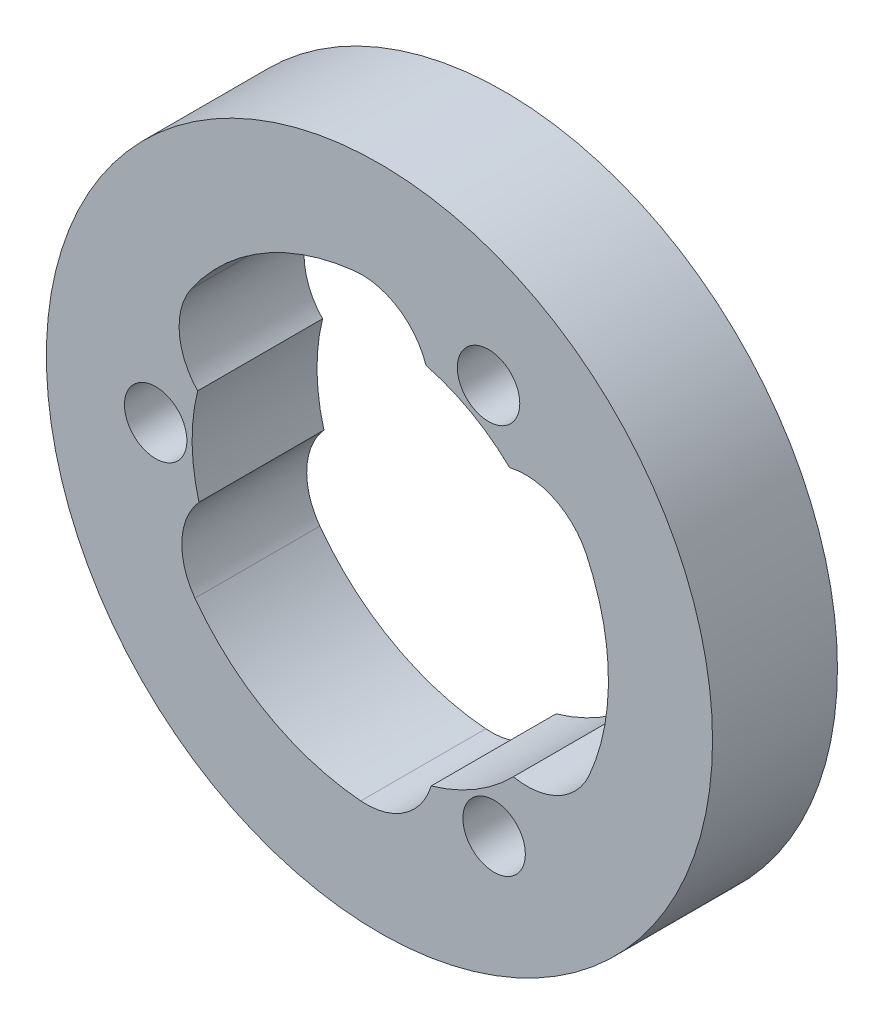
ISO-10303-21;
HEADER;
FILE_DESCRIPTION(('STEP AP214'),'2;1');
FILE_NAME('part.step','',(''),(''),'','','');
FILE_SCHEMA(('AUTOMOTIVE_DESIGN { 1 0 10303 214 1 1 1 1 }'));
ENDSEC;
DATA;
#1=APPLICATION_CONTEXT('core data for automotive mechanical design processes');
#2=APPLICATION_PROTOCOL_DEFINITION('international standard','automotive_design',2000,#1);
#3=PRODUCT_CONTEXT('',#1,'mechanical');
#4=PRODUCT('Part','Part','',(#3));
#5=PRODUCT_RELATED_PRODUCT_CATEGORY('part','',(#4));
#6=PRODUCT_DEFINITION_FORMATION('','',#4);
#7=PRODUCT_DEFINITION_CONTEXT('part definition',#1,'design');
#8=PRODUCT_DEFINITION('design','',#6,#7);
#9=PRODUCT_DEFINITION_SHAPE('','',#8);
#10=(LENGTH_UNIT() NAMED_UNIT(*) SI_UNIT(.MILLI.,.METRE.));
#11=(NAMED_UNIT(*) PLANE_ANGLE_UNIT() SI_UNIT($,.RADIAN.));
#12=(NAMED_UNIT(*) SI_UNIT($,.STERADIAN.) SOLID_ANGLE_UNIT());
#13=UNCERTAINTY_MEASURE_WITH_UNIT(LENGTH_MEASURE(1.E-05),#10,'distance_accuracy_value','');
#14=(GEOMETRIC_REPRESENTATION_CONTEXT(3) GLOBAL_UNCERTAINTY_ASSIGNED_CONTEXT((#13)) GLOBAL_UNIT_ASSIGNED_CONTEXT((#10,
#11,#12)) REPRESENTATION_CONTEXT('',''));
#15=CARTESIAN_POINT('',(0.,0.,0.));
#16=DIRECTION('',(0.,0.,1.));
#17=DIRECTION('',(1.,0.,0.));
#18=AXIS2_PLACEMENT_3D('',#15,#16,#17);
#19=CARTESIAN_POINT('',(0.,0.,6.));
#20=DIRECTION('',(0.,0.,1.));
#21=DIRECTION('',(1.,0.,0.));
#22=AXIS2_PLACEMENT_3D('',#19,#20,#21);
#23=PLANE('',#22);
#24=CARTESIAN_POINT('',(5.24045327565135,9.38616798622926,6.));
#25=DIRECTION('',(0.,0.,1.));
#26=DIRECTION('',(1.,0.,0.));
#27=AXIS2_PLACEMENT_3D('',#24,#25,#26);
#28=CIRCLE('',#27,1.50000000000234);
#29=CARTESIAN_POINT('',(6.74045327565369,9.38616798622926,6.));
#30=VERTEX_POINT('',#29);
#31=EDGE_CURVE('E168',#30,#30,#28,.T.);
#32=ORIENTED_EDGE('',*,*,#31,.F.);
#33=EDGE_LOOP('',(#32));
#34=FACE_BOUND('',#33,.T.);
#35=CARTESIAN_POINT('',(0.,0.,6.));
#36=DIRECTION('',(0.,0.,1.));
#37=DIRECTION('',(1.,0.,0.));
#38=AXIS2_PLACEMENT_3D('',#35,#36,#37);
#39=CIRCLE('',#38,16.);
#40=CARTESIAN_POINT('',(16.,0.,6.));
#41=VERTEX_POINT('',#40);
#42=EDGE_CURVE('E11',#41,#41,#39,.T.);
#43=ORIENTED_EDGE('',*,*,#42,.T.);
#44=EDGE_LOOP('',(#43));
#45=FACE_BOUND('',#44,.T.);
#46=CARTESIAN_POINT('',(-10.7488865580884,-0.154718329055183,6.));
#47=DIRECTION('',(0.,0.,1.));
#48=DIRECTION('',(1.,0.,0.));
#49=AXIS2_PLACEMENT_3D('',#46,#47,#48);
#50=CIRCLE('',#49,1.50000000000232);
#51=CARTESIAN_POINT('',(-9.24888655808612,-0.154718329055183,6.));
#52=VERTEX_POINT('',#51);
#53=EDGE_CURVE('E218',#52,#52,#50,.T.);
#54=ORIENTED_EDGE('',*,*,#53,.F.);
#55=EDGE_LOOP('',(#54));
#56=FACE_BOUND('',#55,.T.);
#57=CARTESIAN_POINT('',(7.0975423071489,-3.11245774240257,6.));
#58=DIRECTION('',(0.,0.,1.));
#59=DIRECTION('',(1.,0.,0.));
#60=AXIS2_PLACEMENT_3D('',#57,#58,#59);
#61=CIRCLE('',#60,3.24999999999875);
#62=CARTESIAN_POINT('',(6.43330341520324,-6.29385471455468,6.));
#63=VERTEX_POINT('',#62);
#64=CARTESIAN_POINT('',(10.073931016597,-4.41768195695787,6.));
#65=VERTEX_POINT('',#64);
#66=EDGE_CURVE('E130',#63,#65,#61,.T.);
#67=ORIENTED_EDGE('',*,*,#66,.F.);
#68=CARTESIAN_POINT('',(0.,0.,6.));
#69=DIRECTION('',(0.,0.,1.));
#70=DIRECTION('',(1.,0.,0.));
#71=AXIS2_PLACEMENT_3D('',#68,#69,#70);
#72=CIRCLE('',#71,9.);
#73=CARTESIAN_POINT('',(2.48399034547737,-8.65042149051551,6.));
#74=VERTEX_POINT('',#73);
#75=EDGE_CURVE('E122',#74,#63,#72,.T.);
#76=ORIENTED_EDGE('',*,*,#75,.F.);
#77=CARTESIAN_POINT('',(-0.6312472118548,-7.72424928116174,6.));
#78=DIRECTION('',(0.,0.,1.));
#79=DIRECTION('',(1.,0.,0.));
#80=AXIS2_PLACEMENT_3D('',#77,#78,#79);
#81=CIRCLE('',#80,3.24999999999879);
#82=CARTESIAN_POINT('',(-0.895963784568005,-10.9634505926154,6.));
#83=VERTEX_POINT('',#82);
#84=EDGE_CURVE('E165',#83,#74,#81,.T.);
#85=ORIENTED_EDGE('',*,*,#84,.F.);
#86=CARTESIAN_POINT('',(0.,0.,6.));
#87=DIRECTION('',(0.,0.,1.));
#88=DIRECTION('',(1.,0.,0.));
#89=AXIS2_PLACEMENT_3D('',#86,#87,#88);
#90=CIRCLE('',#89,10.9999999999984);
#91=CARTESIAN_POINT('',(-8.86279030886419,-6.51543919786609,6.));
#92=VERTEX_POINT('',#91);
#93=EDGE_CURVE('E163',#92,#83,#90,.T.);
#94=ORIENTED_EDGE('',*,*,#93,.F.);
#95=CARTESIAN_POINT('',(-6.24423862670064,-4.59042307122448,6.));
#96=DIRECTION('',(0.,0.,1.));
#97=DIRECTION('',(1.,0.,0.));
#98=AXIS2_PLACEMENT_3D('',#95,#96,#97);
#99=CIRCLE('',#98,3.24999999999875);
#100=CARTESIAN_POINT('',(-8.66728977813536,-2.42447683054101,6.));
#101=VERTEX_POINT('',#100);
#102=EDGE_CURVE('E161',#101,#92,#99,.T.);
#103=ORIENTED_EDGE('',*,*,#102,.F.);
#104=CARTESIAN_POINT('',(0.,0.,6.));
#105=DIRECTION('',(0.,0.,1.));
#106=DIRECTION('',(1.,0.,0.));
#107=AXIS2_PLACEMENT_3D('',#104,#105,#106);
#108=CIRCLE('',#107,9.);
#109=CARTESIAN_POINT('',(-8.73347993696761,2.17401200331915,6.));
#110=VERTEX_POINT('',#109);
#111=EDGE_CURVE('E159',#110,#101,#108,.T.);
#112=ORIENTED_EDGE('',*,*,#111,.F.);
#113=CARTESIAN_POINT('',(-6.37377249672235,4.40880076211523,6.));
#114=DIRECTION('',(0.,0.,1.));
#115=DIRECTION('',(1.,0.,0.));
#116=AXIS2_PLACEMENT_3D('',#113,#114,#115);
#117=CIRCLE('',#116,3.24999999999848);
#118=CARTESIAN_POINT('',(-9.04664483405531,6.25765269461362,6.));
#119=VERTEX_POINT('',#118);
#120=EDGE_CURVE('E157',#119,#110,#117,.T.);
#121=ORIENTED_EDGE('',*,*,#120,.F.);
#122=CARTESIAN_POINT('',(0.,0.,6.));
#123=DIRECTION('',(0.,0.,1.));
#124=DIRECTION('',(1.,0.,0.));
#125=AXIS2_PLACEMENT_3D('',#122,#123,#124);
#126=CIRCLE('',#125,10.9999999999975);
#127=CARTESIAN_POINT('',(-1.21114070773281,10.9331211548235,6.));
#128=VERTEX_POINT('',#127);
#129=EDGE_CURVE('E155',#128,#119,#126,.T.);
#130=ORIENTED_EDGE('',*,*,#129,.F.);
#131=CARTESIAN_POINT('',(-0.853303680448269,7.70288081362704,6.));
#132=DIRECTION('',(0.,0.,1.));
#133=DIRECTION('',(1.,0.,0.));
#134=AXIS2_PLACEMENT_3D('',#131,#132,#133);
#135=CIRCLE('',#134,3.24999999999829);
#136=CARTESIAN_POINT('',(2.23398636293238,8.71833154509693,6.));
#137=VERTEX_POINT('',#136);
#138=EDGE_CURVE('E153',#137,#128,#135,.T.);
#139=ORIENTED_EDGE('',*,*,#138,.F.);
#140=CARTESIAN_POINT('',(0.,0.,6.));
#141=DIRECTION('',(0.,0.,1.));
#142=DIRECTION('',(1.,0.,0.));
#143=AXIS2_PLACEMENT_3D('',#140,#141,#142);
#144=CIRCLE('',#143,9.);
#145=CARTESIAN_POINT('',(6.24948959149037,6.47640948719654,6.));
#146=VERTEX_POINT('',#145);
#147=EDGE_CURVE('E151',#146,#137,#144,.T.);
#148=ORIENTED_EDGE('',*,*,#147,.F.);
#149=CARTESIAN_POINT('',(7.00501970857715,3.31544851904652,6.));
#150=DIRECTION('',(0.,0.,1.));
#151=DIRECTION('',(1.,0.,0.));
#152=AXIS2_PLACEMENT_3D('',#149,#150,#151);
#153=CIRCLE('',#152,3.24999999999894);
#154=CARTESIAN_POINT('',(9.94260861862401,4.70579789800074,6.));
#155=VERTEX_POINT('',#154);
#156=EDGE_CURVE('E146',#155,#146,#153,.T.);
#157=ORIENTED_EDGE('',*,*,#156,.F.);
#158=CARTESIAN_POINT('',(0.,0.,6.));
#159=DIRECTION('',(0.,0.,1.));
#160=DIRECTION('',(1.,0.,0.));
#161=AXIS2_PLACEMENT_3D('',#158,#159,#160);
#162=CIRCLE('',#161,10.9999999999984);
#163=EDGE_CURVE('E144',#65,#155,#162,.T.);
#164=ORIENTED_EDGE('',*,*,#163,.F.);
#165=EDGE_LOOP('',(#67,#76,#85,#94,#103,#112,#121,#130,#139,#148,#157,#164));
#166=FACE_BOUND('',#165,.T.);
#167=CARTESIAN_POINT('',(5.5084332824371,-9.23144965717407,6.));
#168=DIRECTION('',(0.,0.,1.));
#169=DIRECTION('',(1.,0.,0.));
#170=AXIS2_PLACEMENT_3D('',#167,#168,#169);
#171=CIRCLE('',#170,1.50000000000236);
#172=CARTESIAN_POINT('',(7.00843328243946,-9.23144965717407,6.));
#173=VERTEX_POINT('',#172);
#174=EDGE_CURVE('E262',#173,#173,#171,.T.);
#175=ORIENTED_EDGE('',*,*,#174,.F.);
#176=EDGE_LOOP('',(#175));
#177=FACE_BOUND('',#176,.T.);
#178=ADVANCED_FACE('F33',(#34,#45,#56,#166,#177),#23,.T.);
#179=CARTESIAN_POINT('',(0.,0.,0.));
#180=DIRECTION('',(0.,0.,1.));
#181=DIRECTION('',(1.,0.,0.));
#182=AXIS2_PLACEMENT_3D('',#179,#180,#181);
#183=PLANE('',#182);
#184=CARTESIAN_POINT('',(-10.7488865580884,-0.154718329055183,0.));
#185=DIRECTION('',(0.,0.,1.));
#186=DIRECTION('',(1.,0.,0.));
#187=AXIS2_PLACEMENT_3D('',#184,#185,#186);
#188=CIRCLE('',#187,1.50000000000232);
#189=CARTESIAN_POINT('',(-9.24888655808612,-0.154718329055183,0.));
#190=VERTEX_POINT('',#189);
#191=EDGE_CURVE('E138',#190,#190,#188,.T.);
#192=ORIENTED_EDGE('',*,*,#191,.T.);
#193=EDGE_LOOP('',(#192));
#194=FACE_BOUND('',#193,.T.);
#195=CARTESIAN_POINT('',(0.,0.,0.));
#196=DIRECTION('',(0.,0.,1.));
#197=DIRECTION('',(1.,0.,0.));
#198=AXIS2_PLACEMENT_3D('',#195,#196,#197);
#199=CIRCLE('',#198,16.);
#200=CARTESIAN_POINT('',(16.,0.,0.));
#201=VERTEX_POINT('',#200);
#202=EDGE_CURVE('E37',#201,#201,#199,.T.);
#203=ORIENTED_EDGE('',*,*,#202,.F.);
#204=EDGE_LOOP('',(#203));
#205=FACE_BOUND('',#204,.T.);
#206=CARTESIAN_POINT('',(0.,0.,0.));
#207=DIRECTION('',(0.,0.,1.));
#208=DIRECTION('',(1.,0.,0.));
#209=AXIS2_PLACEMENT_3D('',#206,#207,#208);
#210=CIRCLE('',#209,9.);
#211=CARTESIAN_POINT('',(2.48399034547737,-8.65042149051551,0.));
#212=VERTEX_POINT('',#211);
#213=CARTESIAN_POINT('',(6.43330341520324,-6.29385471455468,0.));
#214=VERTEX_POINT('',#213);
#215=EDGE_CURVE('E56',#212,#214,#210,.T.);
#216=ORIENTED_EDGE('',*,*,#215,.T.);
#217=CARTESIAN_POINT('',(7.0975423071489,-3.11245774240257,0.));
#218=DIRECTION('',(0.,0.,1.));
#219=DIRECTION('',(1.,0.,0.));
#220=AXIS2_PLACEMENT_3D('',#217,#218,#219);
#221=CIRCLE('',#220,3.24999999999875);
#222=CARTESIAN_POINT('',(10.073931016597,-4.41768195695787,0.));
#223=VERTEX_POINT('',#222);
#224=EDGE_CURVE('E137',#214,#223,#221,.T.);
#225=ORIENTED_EDGE('',*,*,#224,.T.);
#226=CARTESIAN_POINT('',(0.,0.,0.));
#227=DIRECTION('',(0.,0.,1.));
#228=DIRECTION('',(1.,0.,0.));
#229=AXIS2_PLACEMENT_3D('',#226,#227,#228);
#230=CIRCLE('',#229,10.9999999999984);
#231=CARTESIAN_POINT('',(9.94260861862401,4.70579789800074,0.));
#232=VERTEX_POINT('',#231);
#233=EDGE_CURVE('E170',#223,#232,#230,.T.);
#234=ORIENTED_EDGE('',*,*,#233,.T.);
#235=CARTESIAN_POINT('',(7.00501970857715,3.31544851904652,0.));
#236=DIRECTION('',(0.,0.,1.));
#237=DIRECTION('',(1.,0.,0.));
#238=AXIS2_PLACEMENT_3D('',#235,#236,#237);
#239=CIRCLE('',#238,3.24999999999894);
#240=CARTESIAN_POINT('',(6.24948959149037,6.47640948719654,0.));
#241=VERTEX_POINT('',#240);
#242=EDGE_CURVE('E173',#232,#241,#239,.T.);
#243=ORIENTED_EDGE('',*,*,#242,.T.);
#244=CARTESIAN_POINT('',(0.,0.,0.));
#245=DIRECTION('',(0.,0.,1.));
#246=DIRECTION('',(1.,0.,0.));
#247=AXIS2_PLACEMENT_3D('',#244,#245,#246);
#248=CIRCLE('',#247,9.);
#249=CARTESIAN_POINT('',(2.23398636293238,8.71833154509693,0.));
#250=VERTEX_POINT('',#249);
#251=EDGE_CURVE('E176',#241,#250,#248,.T.);
#252=ORIENTED_EDGE('',*,*,#251,.T.);
#253=CARTESIAN_POINT('',(-0.853303680448269,7.70288081362704,0.));
#254=DIRECTION('',(0.,0.,1.));
#255=DIRECTION('',(1.,0.,0.));
#256=AXIS2_PLACEMENT_3D('',#253,#254,#255);
#257=CIRCLE('',#256,3.24999999999829);
#258=CARTESIAN_POINT('',(-1.21114070773281,10.9331211548235,0.));
#259=VERTEX_POINT('',#258);
#260=EDGE_CURVE('E179',#250,#259,#257,.T.);
#261=ORIENTED_EDGE('',*,*,#260,.T.);
#262=CARTESIAN_POINT('',(0.,0.,0.));
#263=DIRECTION('',(0.,0.,1.));
#264=DIRECTION('',(1.,0.,0.));
#265=AXIS2_PLACEMENT_3D('',#262,#263,#264);
#266=CIRCLE('',#265,10.9999999999975);
#267=CARTESIAN_POINT('',(-9.04664483405531,6.25765269461362,0.));
#268=VERTEX_POINT('',#267);
#269=EDGE_CURVE('E182',#259,#268,#266,.T.);
#270=ORIENTED_EDGE('',*,*,#269,.T.);
#271=CARTESIAN_POINT('',(-6.37377249672235,4.40880076211523,0.));
#272=DIRECTION('',(0.,0.,1.));
#273=DIRECTION('',(1.,0.,0.));
#274=AXIS2_PLACEMENT_3D('',#271,#272,#273);
#275=CIRCLE('',#274,3.24999999999848);
#276=CARTESIAN_POINT('',(-8.73347993696761,2.17401200331915,0.));
#277=VERTEX_POINT('',#276);
#278=EDGE_CURVE('E185',#268,#277,#275,.T.);
#279=ORIENTED_EDGE('',*,*,#278,.T.);
#280=CARTESIAN_POINT('',(0.,0.,0.));
#281=DIRECTION('',(0.,0.,1.));
#282=DIRECTION('',(1.,0.,0.));
#283=AXIS2_PLACEMENT_3D('',#280,#281,#282);
#284=CIRCLE('',#283,9.);
#285=CARTESIAN_POINT('',(-8.66728977813536,-2.42447683054101,0.));
#286=VERTEX_POINT('',#285);
#287=EDGE_CURVE('E188',#277,#286,#284,.T.);
#288=ORIENTED_EDGE('',*,*,#287,.T.);
#289=CARTESIAN_POINT('',(-6.24423862670064,-4.59042307122448,0.));
#290=DIRECTION('',(0.,0.,1.));
#291=DIRECTION('',(1.,0.,0.));
#292=AXIS2_PLACEMENT_3D('',#289,#290,#291);
#293=CIRCLE('',#292,3.24999999999875);
#294=CARTESIAN_POINT('',(-8.86279030886419,-6.51543919786609,0.));
#295=VERTEX_POINT('',#294);
#296=EDGE_CURVE('E191',#286,#295,#293,.T.);
#297=ORIENTED_EDGE('',*,*,#296,.T.);
#298=CARTESIAN_POINT('',(0.,0.,0.));
#299=DIRECTION('',(0.,0.,1.));
#300=DIRECTION('',(1.,0.,0.));
#301=AXIS2_PLACEMENT_3D('',#298,#299,#300);
#302=CIRCLE('',#301,10.9999999999984);
#303=CARTESIAN_POINT('',(-0.895963784567962,-10.9634505926149,0.));
#304=VERTEX_POINT('',#303);
#305=EDGE_CURVE('E194',#295,#304,#302,.T.);
#306=ORIENTED_EDGE('',*,*,#305,.T.);
#307=CARTESIAN_POINT('',(-0.6312472118548,-7.72424928116174,0.));
#308=DIRECTION('',(0.,0.,1.));
#309=DIRECTION('',(1.,0.,0.));
#310=AXIS2_PLACEMENT_3D('',#307,#308,#309);
#311=CIRCLE('',#310,3.24999999999879);
#312=EDGE_CURVE('E131',#304,#212,#311,.T.);
#313=ORIENTED_EDGE('',*,*,#312,.T.);
#314=EDGE_LOOP('',(#216,#225,#234,#243,#252,#261,#270,#279,#288,#297,#306,#313));
#315=FACE_BOUND('',#314,.T.);
#316=CARTESIAN_POINT('',(5.24045327565135,9.38616798622926,0.));
#317=DIRECTION('',(0.,0.,1.));
#318=DIRECTION('',(1.,0.,0.));
#319=AXIS2_PLACEMENT_3D('',#316,#317,#318);
#320=CIRCLE('',#319,1.50000000000234);
#321=CARTESIAN_POINT('',(6.74045327565369,9.38616798622926,0.));
#322=VERTEX_POINT('',#321);
#323=EDGE_CURVE('E257',#322,#322,#320,.T.);
#324=ORIENTED_EDGE('',*,*,#323,.T.);
#325=EDGE_LOOP('',(#324));
#326=FACE_BOUND('',#325,.T.);
#327=CARTESIAN_POINT('',(5.5084332824371,-9.23144965717407,0.));
#328=DIRECTION('',(0.,0.,1.));
#329=DIRECTION('',(1.,0.,0.));
#330=AXIS2_PLACEMENT_3D('',#327,#328,#329);
#331=CIRCLE('',#330,1.50000000000236);
#332=CARTESIAN_POINT('',(7.00843328243946,-9.23144965717407,0.));
#333=VERTEX_POINT('',#332);
#334=EDGE_CURVE('E260',#333,#333,#331,.T.);
#335=ORIENTED_EDGE('',*,*,#334,.T.);
#336=EDGE_LOOP('',(#335));
#337=FACE_BOUND('',#336,.T.);
#338=ADVANCED_FACE('F224',(#194,#205,#315,#326,#337),#183,.F.);
#339=CARTESIAN_POINT('',(0.,0.,6.));
#340=DIRECTION('',(0.,0.,-1.));
#341=DIRECTION('',(-1.,0.,0.));
#342=AXIS2_PLACEMENT_3D('',#339,#340,#341);
#343=CYLINDRICAL_SURFACE('',#342,16.);
#344=ORIENTED_EDGE('',*,*,#42,.F.);
#345=EDGE_LOOP('',(#344));
#346=FACE_BOUND('',#345,.T.);
#347=ORIENTED_EDGE('',*,*,#202,.T.);
#348=EDGE_LOOP('',(#347));
#349=FACE_BOUND('',#348,.T.);
#350=ADVANCED_FACE('F35',(#346,#349),#343,.T.);
#351=CARTESIAN_POINT('',(-10.7488865580884,-0.154718329055183,6.));
#352=DIRECTION('',(0.,0.,-1.));
#353=DIRECTION('',(-1.,0.,0.));
#354=AXIS2_PLACEMENT_3D('',#351,#352,#353);
#355=CYLINDRICAL_SURFACE('',#354,1.50000000000232);
#356=ORIENTED_EDGE('',*,*,#53,.T.);
#357=EDGE_LOOP('',(#356));
#358=FACE_BOUND('',#357,.T.);
#359=ORIENTED_EDGE('',*,*,#191,.F.);
#360=EDGE_LOOP('',(#359));
#361=FACE_BOUND('',#360,.T.);
#362=ADVANCED_FACE('F227',(#358,#361),#355,.F.);
#363=CARTESIAN_POINT('',(0.,0.,6.));
#364=DIRECTION('',(0.,0.,-1.));
#365=DIRECTION('',(-1.,0.,0.));
#366=AXIS2_PLACEMENT_3D('',#363,#364,#365);
#367=CYLINDRICAL_SURFACE('',#366,9.);
#368=ORIENTED_EDGE('',*,*,#215,.F.);
#369=DIRECTION('',(0.,0.,-1.));
#370=VECTOR('',#369,1.);
#371=CARTESIAN_POINT('',(2.48399034547737,-8.65042149051551,6.));
#372=LINE('',#371,#370);
#373=EDGE_CURVE('E126',#74,#212,#372,.T.);
#374=ORIENTED_EDGE('',*,*,#373,.F.);
#375=ORIENTED_EDGE('',*,*,#75,.T.);
#376=DIRECTION('',(0.,0.,-1.));
#377=VECTOR('',#376,1.);
#378=CARTESIAN_POINT('',(6.43330341520324,-6.29385471455468,6.));
#379=LINE('',#378,#377);
#380=EDGE_CURVE('E125',#63,#214,#379,.T.);
#381=ORIENTED_EDGE('',*,*,#380,.T.);
#382=EDGE_LOOP('',(#368,#374,#375,#381));
#383=FACE_BOUND('',#382,.T.);
#384=ADVANCED_FACE('F124',(#383),#367,.F.);
#385=CARTESIAN_POINT('',(7.0975423071489,-3.11245774240257,6.));
#386=DIRECTION('',(0.,0.,-1.));
#387=DIRECTION('',(-1.,0.,0.));
#388=AXIS2_PLACEMENT_3D('',#385,#386,#387);
#389=CYLINDRICAL_SURFACE('',#388,3.24999999999875);
#390=ORIENTED_EDGE('',*,*,#224,.F.);
#391=ORIENTED_EDGE('',*,*,#380,.F.);
#392=ORIENTED_EDGE('',*,*,#66,.T.);
#393=DIRECTION('',(0.,0.,-1.));
#394=VECTOR('',#393,1.);
#395=CARTESIAN_POINT('',(10.073931016597,-4.41768195695787,6.));
#396=LINE('',#395,#394);
#397=EDGE_CURVE('E139',#65,#223,#396,.T.);
#398=ORIENTED_EDGE('',*,*,#397,.T.);
#399=EDGE_LOOP('',(#390,#391,#392,#398));
#400=FACE_BOUND('',#399,.T.);
#401=ADVANCED_FACE('F134',(#400),#389,.F.);
#402=CARTESIAN_POINT('',(0.,0.,6.));
#403=DIRECTION('',(0.,0.,-1.));
#404=DIRECTION('',(-1.,0.,0.));
#405=AXIS2_PLACEMENT_3D('',#402,#403,#404);
#406=CYLINDRICAL_SURFACE('',#405,10.9999999999984);
#407=ORIENTED_EDGE('',*,*,#233,.F.);
#408=ORIENTED_EDGE('',*,*,#397,.F.);
#409=ORIENTED_EDGE('',*,*,#163,.T.);
#410=DIRECTION('',(0.,0.,-1.));
#411=VECTOR('',#410,1.);
#412=CARTESIAN_POINT('',(9.94260861862401,4.70579789800074,6.));
#413=LINE('',#412,#411);
#414=EDGE_CURVE('E215',#155,#232,#413,.T.);
#415=ORIENTED_EDGE('',*,*,#414,.T.);
#416=EDGE_LOOP('',(#407,#408,#409,#415));
#417=FACE_BOUND('',#416,.T.);
#418=ADVANCED_FACE('F313',(#417),#406,.F.);
#419=CARTESIAN_POINT('',(7.00501970857715,3.31544851904652,6.));
#420=DIRECTION('',(0.,0.,-1.));
#421=DIRECTION('',(-1.,0.,0.));
#422=AXIS2_PLACEMENT_3D('',#419,#420,#421);
#423=CYLINDRICAL_SURFACE('',#422,3.24999999999894);
#424=ORIENTED_EDGE('',*,*,#242,.F.);
#425=ORIENTED_EDGE('',*,*,#414,.F.);
#426=ORIENTED_EDGE('',*,*,#156,.T.);
#427=DIRECTION('',(0.,0.,-1.));
#428=VECTOR('',#427,1.);
#429=CARTESIAN_POINT('',(6.24948959149037,6.47640948719654,6.));
#430=LINE('',#429,#428);
#431=EDGE_CURVE('E213',#146,#241,#430,.T.);
#432=ORIENTED_EDGE('',*,*,#431,.T.);
#433=EDGE_LOOP('',(#424,#425,#426,#432));
#434=FACE_BOUND('',#433,.T.);
#435=ADVANCED_FACE('F309',(#434),#423,.F.);
#436=CARTESIAN_POINT('',(0.,0.,6.));
#437=DIRECTION('',(0.,0.,-1.));
#438=DIRECTION('',(-1.,0.,0.));
#439=AXIS2_PLACEMENT_3D('',#436,#437,#438);
#440=CYLINDRICAL_SURFACE('',#439,9.);
#441=ORIENTED_EDGE('',*,*,#251,.F.);
#442=ORIENTED_EDGE('',*,*,#431,.F.);
#443=ORIENTED_EDGE('',*,*,#147,.T.);
#444=DIRECTION('',(0.,0.,-1.));
#445=VECTOR('',#444,1.);
#446=CARTESIAN_POINT('',(2.23398636293238,8.71833154509693,6.));
#447=LINE('',#446,#445);
#448=EDGE_CURVE('E211',#137,#250,#447,.T.);
#449=ORIENTED_EDGE('',*,*,#448,.T.);
#450=EDGE_LOOP('',(#441,#442,#443,#449));
#451=FACE_BOUND('',#450,.T.);
#452=ADVANCED_FACE('F305',(#451),#440,.F.);
#453=CARTESIAN_POINT('',(-0.853303680448269,7.70288081362704,6.));
#454=DIRECTION('',(0.,0.,-1.));
#455=DIRECTION('',(-1.,0.,0.));
#456=AXIS2_PLACEMENT_3D('',#453,#454,#455);
#457=CYLINDRICAL_SURFACE('',#456,3.24999999999829);
#458=ORIENTED_EDGE('',*,*,#260,.F.);
#459=ORIENTED_EDGE('',*,*,#448,.F.);
#460=ORIENTED_EDGE('',*,*,#138,.T.);
#461=DIRECTION('',(0.,0.,-1.));
#462=VECTOR('',#461,1.);
#463=CARTESIAN_POINT('',(-1.21114070773281,10.9331211548235,6.));
#464=LINE('',#463,#462);
#465=EDGE_CURVE('E209',#128,#259,#464,.T.);
#466=ORIENTED_EDGE('',*,*,#465,.T.);
#467=EDGE_LOOP('',(#458,#459,#460,#466));
#468=FACE_BOUND('',#467,.T.);
#469=ADVANCED_FACE('F301',(#468),#457,.F.);
#470=CARTESIAN_POINT('',(0.,0.,6.));
#471=DIRECTION('',(0.,0.,-1.));
#472=DIRECTION('',(-1.,0.,0.));
#473=AXIS2_PLACEMENT_3D('',#470,#471,#472);
#474=CYLINDRICAL_SURFACE('',#473,10.9999999999975);
#475=ORIENTED_EDGE('',*,*,#269,.F.);
#476=ORIENTED_EDGE('',*,*,#465,.F.);
#477=ORIENTED_EDGE('',*,*,#129,.T.);
#478=DIRECTION('',(0.,0.,-1.));
#479=VECTOR('',#478,1.);
#480=CARTESIAN_POINT('',(-9.04664483405531,6.25765269461362,6.));
#481=LINE('',#480,#479);
#482=EDGE_CURVE('E207',#119,#268,#481,.T.);
#483=ORIENTED_EDGE('',*,*,#482,.T.);
#484=EDGE_LOOP('',(#475,#476,#477,#483));
#485=FACE_BOUND('',#484,.T.);
#486=ADVANCED_FACE('F297',(#485),#474,.F.);
#487=CARTESIAN_POINT('',(-6.37377249672235,4.40880076211523,6.));
#488=DIRECTION('',(0.,0.,-1.));
#489=DIRECTION('',(-1.,0.,0.));
#490=AXIS2_PLACEMENT_3D('',#487,#488,#489);
#491=CYLINDRICAL_SURFACE('',#490,3.24999999999848);
#492=ORIENTED_EDGE('',*,*,#278,.F.);
#493=ORIENTED_EDGE('',*,*,#482,.F.);
#494=ORIENTED_EDGE('',*,*,#120,.T.);
#495=DIRECTION('',(0.,0.,-1.));
#496=VECTOR('',#495,1.);
#497=CARTESIAN_POINT('',(-8.73347993696761,2.17401200331915,6.));
#498=LINE('',#497,#496);
#499=EDGE_CURVE('E205',#110,#277,#498,.T.);
#500=ORIENTED_EDGE('',*,*,#499,.T.);
#501=EDGE_LOOP('',(#492,#493,#494,#500));
#502=FACE_BOUND('',#501,.T.);
#503=ADVANCED_FACE('F293',(#502),#491,.F.);
#504=CARTESIAN_POINT('',(0.,0.,6.));
#505=DIRECTION('',(0.,0.,-1.));
#506=DIRECTION('',(-1.,0.,0.));
#507=AXIS2_PLACEMENT_3D('',#504,#505,#506);
#508=CYLINDRICAL_SURFACE('',#507,9.);
#509=ORIENTED_EDGE('',*,*,#287,.F.);
#510=ORIENTED_EDGE('',*,*,#499,.F.);
#511=ORIENTED_EDGE('',*,*,#111,.T.);
#512=DIRECTION('',(0.,0.,-1.));
#513=VECTOR('',#512,1.);
#514=CARTESIAN_POINT('',(-8.66728977813536,-2.42447683054101,6.));
#515=LINE('',#514,#513);
#516=EDGE_CURVE('E203',#101,#286,#515,.T.);
#517=ORIENTED_EDGE('',*,*,#516,.T.);
#518=EDGE_LOOP('',(#509,#510,#511,#517));
#519=FACE_BOUND('',#518,.T.);
#520=ADVANCED_FACE('F289',(#519),#508,.F.);
#521=CARTESIAN_POINT('',(-6.24423862670064,-4.59042307122448,6.));
#522=DIRECTION('',(0.,0.,-1.));
#523=DIRECTION('',(-1.,0.,0.));
#524=AXIS2_PLACEMENT_3D('',#521,#522,#523);
#525=CYLINDRICAL_SURFACE('',#524,3.24999999999875);
#526=ORIENTED_EDGE('',*,*,#296,.F.);
#527=ORIENTED_EDGE('',*,*,#516,.F.);
#528=ORIENTED_EDGE('',*,*,#102,.T.);
#529=DIRECTION('',(0.,0.,-1.));
#530=VECTOR('',#529,1.);
#531=CARTESIAN_POINT('',(-8.86279030886419,-6.51543919786609,6.));
#532=LINE('',#531,#530);
#533=EDGE_CURVE('E201',#92,#295,#532,.T.);
#534=ORIENTED_EDGE('',*,*,#533,.T.);
#535=EDGE_LOOP('',(#526,#527,#528,#534));
#536=FACE_BOUND('',#535,.T.);
#537=ADVANCED_FACE('F285',(#536),#525,.F.);
#538=CARTESIAN_POINT('',(0.,0.,6.));
#539=DIRECTION('',(0.,0.,-1.));
#540=DIRECTION('',(-1.,0.,0.));
#541=AXIS2_PLACEMENT_3D('',#538,#539,#540);
#542=CYLINDRICAL_SURFACE('',#541,10.9999999999984);
#543=ORIENTED_EDGE('',*,*,#305,.F.);
#544=ORIENTED_EDGE('',*,*,#533,.F.);
#545=ORIENTED_EDGE('',*,*,#93,.T.);
#546=DIRECTION('',(0.,0.,-1.));
#547=VECTOR('',#546,1.);
#548=CARTESIAN_POINT('',(-0.895963784567962,-10.9634505926149,6.));
#549=LINE('',#548,#547);
#550=EDGE_CURVE('E48',#83,#304,#549,.T.);
#551=ORIENTED_EDGE('',*,*,#550,.T.);
#552=EDGE_LOOP('',(#543,#544,#545,#551));
#553=FACE_BOUND('',#552,.T.);
#554=ADVANCED_FACE('F280',(#553),#542,.F.);
#555=CARTESIAN_POINT('',(-0.6312472118548,-7.72424928116174,6.));
#556=DIRECTION('',(0.,0.,-1.));
#557=DIRECTION('',(-1.,0.,0.));
#558=AXIS2_PLACEMENT_3D('',#555,#556,#557);
#559=CYLINDRICAL_SURFACE('',#558,3.24999999999879);
#560=ORIENTED_EDGE('',*,*,#312,.F.);
#561=ORIENTED_EDGE('',*,*,#550,.F.);
#562=ORIENTED_EDGE('',*,*,#84,.T.);
#563=ORIENTED_EDGE('',*,*,#373,.T.);
#564=EDGE_LOOP('',(#560,#561,#562,#563));
#565=FACE_BOUND('',#564,.T.);
#566=ADVANCED_FACE('F272',(#565),#559,.F.);
#567=CARTESIAN_POINT('',(5.24045327565135,9.38616798622926,6.));
#568=DIRECTION('',(0.,0.,-1.));
#569=DIRECTION('',(-1.,0.,0.));
#570=AXIS2_PLACEMENT_3D('',#567,#568,#569);
#571=CYLINDRICAL_SURFACE('',#570,1.50000000000234);
#572=ORIENTED_EDGE('',*,*,#31,.T.);
#573=EDGE_LOOP('',(#572));
#574=FACE_BOUND('',#573,.T.);
#575=ORIENTED_EDGE('',*,*,#323,.F.);
#576=EDGE_LOOP('',(#575));
#577=FACE_BOUND('',#576,.T.);
#578=ADVANCED_FACE('F268',(#574,#577),#571,.F.);
#579=CARTESIAN_POINT('',(5.5084332824371,-9.23144965717407,6.));
#580=DIRECTION('',(0.,0.,-1.));
#581=DIRECTION('',(-1.,0.,0.));
#582=AXIS2_PLACEMENT_3D('',#579,#580,#581);
#583=CYLINDRICAL_SURFACE('',#582,1.50000000000236);
#584=ORIENTED_EDGE('',*,*,#174,.T.);
#585=EDGE_LOOP('',(#584));
#586=FACE_BOUND('',#585,.T.);
#587=ORIENTED_EDGE('',*,*,#334,.F.);
#588=EDGE_LOOP('',(#587));
#589=FACE_BOUND('',#588,.T.);
#590=ADVANCED_FACE('F271',(#586,#589),#583,.F.);
#591=CLOSED_SHELL('',(#178,#338,#350,#362,#384,#401,#418,#435,#452,#469,#486,#503,#520,#537,
#554,#566,#578,#590));
#592=MANIFOLD_SOLID_BREP('B2',#591);
#593=ADVANCED_BREP_SHAPE_REPRESENTATION('',(#18,#592),#14);
#594=SHAPE_DEFINITION_REPRESENTATION(#9,#593);
ENDSEC;
END-ISO-10303-21;
